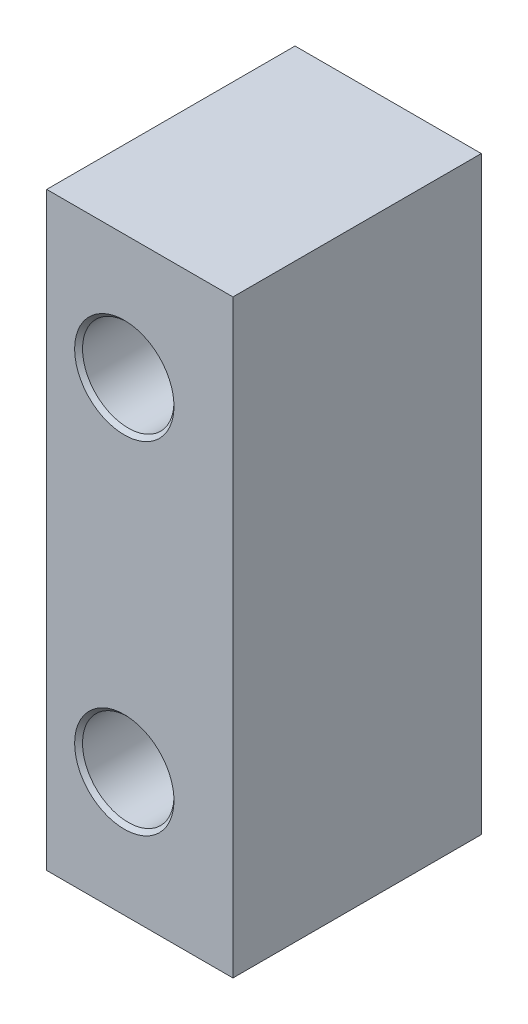
ISO-10303-21;
HEADER;
FILE_DESCRIPTION(('STEP AP214'),'2;1');
FILE_NAME('part.step','',(''),(''),'','','');
FILE_SCHEMA(('AUTOMOTIVE_DESIGN { 1 0 10303 214 1 1 1 1 }'));
ENDSEC;
DATA;
#1=APPLICATION_CONTEXT('core data for automotive mechanical design processes');
#2=APPLICATION_PROTOCOL_DEFINITION('international standard','automotive_design',2000,#1);
#3=PRODUCT_CONTEXT('',#1,'mechanical');
#4=PRODUCT('Part','Part','',(#3));
#5=PRODUCT_RELATED_PRODUCT_CATEGORY('part','',(#4));
#6=PRODUCT_DEFINITION_FORMATION('','',#4);
#7=PRODUCT_DEFINITION_CONTEXT('part definition',#1,'design');
#8=PRODUCT_DEFINITION('design','',#6,#7);
#9=PRODUCT_DEFINITION_SHAPE('','',#8);
#10=(LENGTH_UNIT() NAMED_UNIT(*) SI_UNIT(.MILLI.,.METRE.));
#11=(NAMED_UNIT(*) PLANE_ANGLE_UNIT() SI_UNIT($,.RADIAN.));
#12=(NAMED_UNIT(*) SI_UNIT($,.STERADIAN.) SOLID_ANGLE_UNIT());
#13=UNCERTAINTY_MEASURE_WITH_UNIT(LENGTH_MEASURE(1.E-05),#10,'distance_accuracy_value','');
#14=(GEOMETRIC_REPRESENTATION_CONTEXT(3) GLOBAL_UNCERTAINTY_ASSIGNED_CONTEXT((#13)) GLOBAL_UNIT_ASSIGNED_CONTEXT((#10,
#11,#12)) REPRESENTATION_CONTEXT('',''));
#15=CARTESIAN_POINT('',(0.,0.,0.));
#16=DIRECTION('',(0.,0.,1.));
#17=DIRECTION('',(1.,0.,0.));
#18=AXIS2_PLACEMENT_3D('',#15,#16,#17);
#19=CARTESIAN_POINT('',(3.,-9.5,8.));
#20=DIRECTION('',(-1.,0.,0.));
#21=DIRECTION('',(0.,0.,1.));
#22=AXIS2_PLACEMENT_3D('',#19,#20,#21);
#23=PLANE('',#22);
#24=DIRECTION('',(0.,1.,0.));
#25=VECTOR('',#24,1.);
#26=CARTESIAN_POINT('',(3.,-9.5,0.));
#27=LINE('',#26,#25);
#28=CARTESIAN_POINT('',(3.,-9.5,0.));
#29=VERTEX_POINT('',#28);
#30=CARTESIAN_POINT('',(3.,9.5,0.));
#31=VERTEX_POINT('',#30);
#32=EDGE_CURVE('E154',#29,#31,#27,.T.);
#33=ORIENTED_EDGE('',*,*,#32,.T.);
#34=DIRECTION('',(0.,0.,-1.));
#35=VECTOR('',#34,1.);
#36=CARTESIAN_POINT('',(3.,9.5,8.));
#37=LINE('',#36,#35);
#38=CARTESIAN_POINT('',(3.,9.5,8.));
#39=VERTEX_POINT('',#38);
#40=EDGE_CURVE('E135',#39,#31,#37,.T.);
#41=ORIENTED_EDGE('',*,*,#40,.F.);
#42=DIRECTION('',(0.,1.,0.));
#43=VECTOR('',#42,1.);
#44=CARTESIAN_POINT('',(3.,-9.5,8.));
#45=LINE('',#44,#43);
#46=CARTESIAN_POINT('',(3.,-9.5,8.));
#47=VERTEX_POINT('',#46);
#48=EDGE_CURVE('E142',#47,#39,#45,.T.);
#49=ORIENTED_EDGE('',*,*,#48,.F.);
#50=DIRECTION('',(0.,0.,-1.));
#51=VECTOR('',#50,1.);
#52=CARTESIAN_POINT('',(3.,-9.5,8.));
#53=LINE('',#52,#51);
#54=EDGE_CURVE('E342',#47,#29,#53,.T.);
#55=ORIENTED_EDGE('',*,*,#54,.T.);
#56=EDGE_LOOP('',(#33,#41,#49,#55));
#57=FACE_BOUND('',#56,.T.);
#58=ADVANCED_FACE('F30',(#57),#23,.F.);
#59=CARTESIAN_POINT('',(-3.,9.5,8.));
#60=DIRECTION('',(0.,-1.,0.));
#61=DIRECTION('',(0.,0.,-1.));
#62=AXIS2_PLACEMENT_3D('',#59,#60,#61);
#63=PLANE('',#62);
#64=DIRECTION('',(-1.,0.,0.));
#65=VECTOR('',#64,1.);
#66=CARTESIAN_POINT('',(-3.,9.5,0.));
#67=LINE('',#66,#65);
#68=CARTESIAN_POINT('',(-3.,9.5,0.));
#69=VERTEX_POINT('',#68);
#70=EDGE_CURVE('E344',#31,#69,#67,.T.);
#71=ORIENTED_EDGE('',*,*,#70,.T.);
#72=DIRECTION('',(0.,0.,-1.));
#73=VECTOR('',#72,1.);
#74=CARTESIAN_POINT('',(-3.,9.5,8.));
#75=LINE('',#74,#73);
#76=CARTESIAN_POINT('',(-3.,9.5,8.));
#77=VERTEX_POINT('',#76);
#78=EDGE_CURVE('E138',#77,#69,#75,.T.);
#79=ORIENTED_EDGE('',*,*,#78,.F.);
#80=DIRECTION('',(-1.,0.,0.));
#81=VECTOR('',#80,1.);
#82=CARTESIAN_POINT('',(-3.,9.5,8.));
#83=LINE('',#82,#81);
#84=EDGE_CURVE('E131',#39,#77,#83,.T.);
#85=ORIENTED_EDGE('',*,*,#84,.F.);
#86=ORIENTED_EDGE('',*,*,#40,.T.);
#87=EDGE_LOOP('',(#71,#79,#85,#86));
#88=FACE_BOUND('',#87,.T.);
#89=ADVANCED_FACE('F133',(#88),#63,.F.);
#90=CARTESIAN_POINT('',(-3.,-9.5,8.));
#91=DIRECTION('',(1.,0.,0.));
#92=DIRECTION('',(0.,0.,-1.));
#93=AXIS2_PLACEMENT_3D('',#90,#91,#92);
#94=PLANE('',#93);
#95=DIRECTION('',(0.,-1.,0.));
#96=VECTOR('',#95,1.);
#97=CARTESIAN_POINT('',(-3.,-9.5,0.));
#98=LINE('',#97,#96);
#99=CARTESIAN_POINT('',(-3.,3.8375451121956,0.));
#100=VERTEX_POINT('',#99);
#101=CARTESIAN_POINT('',(-3.,-3.8375451121956,0.));
#102=VERTEX_POINT('',#101);
#103=EDGE_CURVE('E349',#100,#102,#98,.T.);
#104=ORIENTED_EDGE('',*,*,#103,.T.);
#105=DIRECTION('',(0.,0.,1.));
#106=VECTOR('',#105,1.);
#107=CARTESIAN_POINT('',(-3.,-3.8375451121956,8.));
#108=LINE('',#107,#106);
#109=CARTESIAN_POINT('',(-3.,-3.8375451121956,2.8448));
#110=VERTEX_POINT('',#109);
#111=EDGE_CURVE('E173',#102,#110,#108,.T.);
#112=ORIENTED_EDGE('',*,*,#111,.T.);
#113=DIRECTION('',(0.,-1.,0.));
#114=VECTOR('',#113,1.);
#115=CARTESIAN_POINT('',(-3.,-9.5,2.8448));
#116=LINE('',#115,#114);
#117=CARTESIAN_POINT('',(-3.,-7.1624548878044,2.8448));
#118=VERTEX_POINT('',#117);
#119=EDGE_CURVE('E155',#110,#118,#116,.T.);
#120=ORIENTED_EDGE('',*,*,#119,.T.);
#121=DIRECTION('',(0.,0.,-1.));
#122=VECTOR('',#121,1.);
#123=CARTESIAN_POINT('',(-3.,-7.1624548878044,8.));
#124=LINE('',#123,#122);
#125=CARTESIAN_POINT('',(-3.,-7.1624548878044,0.));
#126=VERTEX_POINT('',#125);
#127=EDGE_CURVE('E170',#118,#126,#124,.T.);
#128=ORIENTED_EDGE('',*,*,#127,.T.);
#129=CARTESIAN_POINT('',(-3.,-9.5,0.));
#130=VERTEX_POINT('',#129);
#131=EDGE_CURVE('E346',#126,#130,#98,.T.);
#132=ORIENTED_EDGE('',*,*,#131,.T.);
#133=DIRECTION('',(0.,0.,-1.));
#134=VECTOR('',#133,1.);
#135=CARTESIAN_POINT('',(-3.,-9.5,8.));
#136=LINE('',#135,#134);
#137=CARTESIAN_POINT('',(-3.,-9.5,8.));
#138=VERTEX_POINT('',#137);
#139=EDGE_CURVE('E159',#138,#130,#136,.T.);
#140=ORIENTED_EDGE('',*,*,#139,.F.);
#141=DIRECTION('',(0.,-1.,0.));
#142=VECTOR('',#141,1.);
#143=CARTESIAN_POINT('',(-3.,-9.5,8.));
#144=LINE('',#143,#142);
#145=EDGE_CURVE('E141',#77,#138,#144,.T.);
#146=ORIENTED_EDGE('',*,*,#145,.F.);
#147=ORIENTED_EDGE('',*,*,#78,.T.);
#148=CARTESIAN_POINT('',(-3.,7.1624548878044,0.));
#149=VERTEX_POINT('',#148);
#150=EDGE_CURVE('E347',#69,#149,#98,.T.);
#151=ORIENTED_EDGE('',*,*,#150,.T.);
#152=DIRECTION('',(0.,0.,1.));
#153=VECTOR('',#152,1.);
#154=CARTESIAN_POINT('',(-3.,7.1624548878044,8.));
#155=LINE('',#154,#153);
#156=CARTESIAN_POINT('',(-3.,7.1624548878044,2.8448));
#157=VERTEX_POINT('',#156);
#158=EDGE_CURVE('E164',#149,#157,#155,.T.);
#159=ORIENTED_EDGE('',*,*,#158,.T.);
#160=DIRECTION('',(0.,-1.,0.));
#161=VECTOR('',#160,1.);
#162=CARTESIAN_POINT('',(-3.,-9.5,2.8448));
#163=LINE('',#162,#161);
#164=CARTESIAN_POINT('',(-3.,3.8375451121956,2.8448));
#165=VERTEX_POINT('',#164);
#166=EDGE_CURVE('E157',#157,#165,#163,.T.);
#167=ORIENTED_EDGE('',*,*,#166,.T.);
#168=DIRECTION('',(0.,0.,-1.));
#169=VECTOR('',#168,1.);
#170=CARTESIAN_POINT('',(-3.,3.8375451121956,8.));
#171=LINE('',#170,#169);
#172=EDGE_CURVE('E167',#165,#100,#171,.T.);
#173=ORIENTED_EDGE('',*,*,#172,.T.);
#174=EDGE_LOOP('',(#104,#112,#120,#128,#132,#140,#146,#147,#151,#159,#167,#173));
#175=FACE_BOUND('',#174,.T.);
#176=ADVANCED_FACE('F235',(#175),#94,.F.);
#177=CARTESIAN_POINT('',(-3.,-9.5,8.));
#178=DIRECTION('',(0.,1.,0.));
#179=DIRECTION('',(0.,0.,1.));
#180=AXIS2_PLACEMENT_3D('',#177,#178,#179);
#181=PLANE('',#180);
#182=DIRECTION('',(1.,0.,0.));
#183=VECTOR('',#182,1.);
#184=CARTESIAN_POINT('',(-3.,-9.5,0.));
#185=LINE('',#184,#183);
#186=EDGE_CURVE('E151',#130,#29,#185,.T.);
#187=ORIENTED_EDGE('',*,*,#186,.T.);
#188=ORIENTED_EDGE('',*,*,#54,.F.);
#189=DIRECTION('',(1.,0.,0.));
#190=VECTOR('',#189,1.);
#191=CARTESIAN_POINT('',(-3.,-9.5,8.));
#192=LINE('',#191,#190);
#193=EDGE_CURVE('E147',#138,#47,#192,.T.);
#194=ORIENTED_EDGE('',*,*,#193,.F.);
#195=ORIENTED_EDGE('',*,*,#139,.T.);
#196=EDGE_LOOP('',(#187,#188,#194,#195));
#197=FACE_BOUND('',#196,.T.);
#198=ADVANCED_FACE('F228',(#197),#181,.F.);
#199=CARTESIAN_POINT('',(3.,9.5,8.));
#200=DIRECTION('',(0.,0.,-1.));
#201=DIRECTION('',(-1.,0.,0.));
#202=AXIS2_PLACEMENT_3D('',#199,#200,#201);
#203=PLANE('',#202);
#204=CARTESIAN_POINT('',(-0.5,5.5,8.));
#205=DIRECTION('',(0.,0.,-1.));
#206=DIRECTION('',(-1.,0.,0.));
#207=AXIS2_PLACEMENT_3D('',#204,#205,#206);
#208=CIRCLE('',#207,1.6002);
#209=CARTESIAN_POINT('',(-2.1002,5.5,8.));
#210=VERTEX_POINT('',#209);
#211=EDGE_CURVE('E383',#210,#210,#208,.T.);
#212=ORIENTED_EDGE('',*,*,#211,.T.);
#213=EDGE_LOOP('',(#212));
#214=FACE_BOUND('',#213,.T.);
#215=CARTESIAN_POINT('',(-0.5,-5.5,8.));
#216=DIRECTION('',(0.,0.,-1.));
#217=DIRECTION('',(-1.,0.,0.));
#218=AXIS2_PLACEMENT_3D('',#215,#216,#217);
#219=CIRCLE('',#218,1.6002);
#220=CARTESIAN_POINT('',(-2.1002,-5.5,8.));
#221=VERTEX_POINT('',#220);
#222=EDGE_CURVE('E314',#221,#221,#219,.T.);
#223=ORIENTED_EDGE('',*,*,#222,.T.);
#224=EDGE_LOOP('',(#223));
#225=FACE_BOUND('',#224,.T.);
#226=ORIENTED_EDGE('',*,*,#48,.T.);
#227=ORIENTED_EDGE('',*,*,#84,.T.);
#228=ORIENTED_EDGE('',*,*,#145,.T.);
#229=ORIENTED_EDGE('',*,*,#193,.T.);
#230=EDGE_LOOP('',(#226,#227,#228,#229));
#231=FACE_BOUND('',#230,.T.);
#232=ADVANCED_FACE('F145',(#214,#225,#231),#203,.F.);
#233=CARTESIAN_POINT('',(3.,9.5,0.));
#234=DIRECTION('',(0.,0.,-1.));
#235=DIRECTION('',(-1.,0.,0.));
#236=AXIS2_PLACEMENT_3D('',#233,#234,#235);
#237=PLANE('',#236);
#238=CARTESIAN_POINT('',(-0.5,-5.5,0.));
#239=DIRECTION('',(0.,0.,-1.));
#240=DIRECTION('',(-1.,0.,0.));
#241=AXIS2_PLACEMENT_3D('',#238,#239,#240);
#242=CIRCLE('',#241,2.90576);
#243=CARTESIAN_POINT('',(-2.88304335898056,-3.83730774741126,0.));
#244=VERTEX_POINT('',#243);
#245=CARTESIAN_POINT('',(-2.88304335898056,-7.16269225258875,0.));
#246=VERTEX_POINT('',#245);
#247=EDGE_CURVE('E323',#244,#246,#242,.T.);
#248=ORIENTED_EDGE('',*,*,#247,.F.);
#249=DIRECTION('',(-0.999997940549001,-0.00202950677646935,0.));
#250=VECTOR('',#249,1.);
#251=CARTESIAN_POINT('',(3.0270438690536,-3.82531316063017,0.));
#252=LINE('',#251,#250);
#253=EDGE_CURVE('E262',#244,#102,#252,.T.);
#254=ORIENTED_EDGE('',*,*,#253,.T.);
#255=ORIENTED_EDGE('',*,*,#103,.F.);
#256=DIRECTION('',(-0.999997940549002,0.00202950677647095,0.));
#257=VECTOR('',#256,1.);
#258=CARTESIAN_POINT('',(2.9884833197144,3.82539141968752,0.));
#259=LINE('',#258,#257);
#260=CARTESIAN_POINT('',(-2.88304335898056,3.83730774741125,0.));
#261=VERTEX_POINT('',#260);
#262=EDGE_CURVE('E267',#100,#261,#259,.F.);
#263=ORIENTED_EDGE('',*,*,#262,.T.);
#264=CARTESIAN_POINT('',(-0.5,5.5,0.));
#265=DIRECTION('',(0.,0.,-1.));
#266=DIRECTION('',(-1.,0.,0.));
#267=AXIS2_PLACEMENT_3D('',#264,#265,#266);
#268=CIRCLE('',#267,2.90576);
#269=CARTESIAN_POINT('',(-2.88304335898056,7.16269225258874,0.));
#270=VERTEX_POINT('',#269);
#271=EDGE_CURVE('E381',#270,#261,#268,.T.);
#272=ORIENTED_EDGE('',*,*,#271,.F.);
#273=DIRECTION('',(-0.999997940549001,-0.00202950677646935,0.));
#274=VECTOR('',#273,1.);
#275=CARTESIAN_POINT('',(3.0047193404888,7.17464153149451,0.));
#276=LINE('',#275,#274);
#277=EDGE_CURVE('E266',#270,#149,#276,.T.);
#278=ORIENTED_EDGE('',*,*,#277,.T.);
#279=ORIENTED_EDGE('',*,*,#150,.F.);
#280=ORIENTED_EDGE('',*,*,#70,.F.);
#281=ORIENTED_EDGE('',*,*,#32,.F.);
#282=ORIENTED_EDGE('',*,*,#186,.F.);
#283=ORIENTED_EDGE('',*,*,#131,.F.);
#284=DIRECTION('',(-0.999997940549001,0.00202950677646936,0.));
#285=VECTOR('',#284,1.);
#286=CARTESIAN_POINT('',(2.96615879114961,-7.17456327243716,0.));
#287=LINE('',#286,#285);
#288=EDGE_CURVE('E272',#126,#246,#287,.F.);
#289=ORIENTED_EDGE('',*,*,#288,.T.);
#290=EDGE_LOOP('',(#248,#254,#255,#263,#272,#278,#279,#280,#281,#282,#283,#289));
#291=FACE_BOUND('',#290,.T.);
#292=ADVANCED_FACE('F212',(#291),#237,.T.);
#293=CARTESIAN_POINT('',(1.1002,-5.5,2.8448));
#294=DIRECTION('',(0.,0.,1.));
#295=DIRECTION('',(1.,0.,0.));
#296=AXIS2_PLACEMENT_3D('',#293,#294,#295);
#297=PLANE('',#296);
#298=CARTESIAN_POINT('',(-0.5,-5.5,2.8448));
#299=DIRECTION('',(0.,0.,-1.));
#300=DIRECTION('',(-1.,0.,0.));
#301=AXIS2_PLACEMENT_3D('',#298,#299,#300);
#302=CIRCLE('',#301,1.6002);
#303=CARTESIAN_POINT('',(-2.1002,-5.5,2.8448));
#304=VERTEX_POINT('',#303);
#305=EDGE_CURVE('E331',#304,#304,#302,.T.);
#306=ORIENTED_EDGE('',*,*,#305,.F.);
#307=EDGE_LOOP('',(#306));
#308=FACE_BOUND('',#307,.T.);
#309=ORIENTED_EDGE('',*,*,#119,.F.);
#310=DIRECTION('',(0.999997940549001,0.00202950677646935,0.));
#311=VECTOR('',#310,1.);
#312=CARTESIAN_POINT('',(1.09680915518356,-3.82923059312991,2.8448));
#313=LINE('',#312,#311);
#314=CARTESIAN_POINT('',(-2.72618572726878,-3.83698940312914,2.8448));
#315=VERTEX_POINT('',#314);
#316=EDGE_CURVE('E362',#110,#315,#313,.T.);
#317=ORIENTED_EDGE('',*,*,#316,.T.);
#318=CARTESIAN_POINT('',(-0.5,-5.5,2.8448));
#319=DIRECTION('',(0.,0.,-1.));
#320=DIRECTION('',(-1.,0.,0.));
#321=AXIS2_PLACEMENT_3D('',#318,#319,#320);
#322=CIRCLE('',#321,2.77876);
#323=CARTESIAN_POINT('',(-2.72618572726878,-7.16301059687086,2.8448));
#324=VERTEX_POINT('',#323);
#325=EDGE_CURVE('E328',#315,#324,#322,.T.);
#326=ORIENTED_EDGE('',*,*,#325,.T.);
#327=DIRECTION('',(0.999997940549001,-0.00202950677646936,0.));
#328=VECTOR('',#327,1.);
#329=CARTESIAN_POINT('',(1.09680915518356,-7.17076940687009,2.8448));
#330=LINE('',#329,#328);
#331=EDGE_CURVE('E366',#324,#118,#330,.F.);
#332=ORIENTED_EDGE('',*,*,#331,.T.);
#333=EDGE_LOOP('',(#309,#317,#326,#332));
#334=FACE_BOUND('',#333,.T.);
#335=ADVANCED_FACE('F208',(#308,#334),#297,.F.);
#336=CARTESIAN_POINT('',(-0.5,-5.5,0.));
#337=DIRECTION('',(0.,0.,-1.));
#338=DIRECTION('',(-1.,0.,0.));
#339=AXIS2_PLACEMENT_3D('',#336,#337,#338);
#340=CYLINDRICAL_SURFACE('',#339,2.77876);
#341=ORIENTED_EDGE('',*,*,#325,.F.);
#342=DIRECTION('',(0.,0.,-1.));
#343=VECTOR('',#342,1.);
#344=CARTESIAN_POINT('',(-2.72618572726878,-3.83698940312914,0.));
#345=LINE('',#344,#343);
#346=CARTESIAN_POINT('',(-2.72618572726878,-3.83698940312914,0.127000000000001));
#347=VERTEX_POINT('',#346);
#348=EDGE_CURVE('E178',#315,#347,#345,.T.);
#349=ORIENTED_EDGE('',*,*,#348,.T.);
#350=CARTESIAN_POINT('',(-0.5,-5.5,0.127000000000001));
#351=DIRECTION('',(0.,0.,-1.));
#352=DIRECTION('',(-1.,0.,0.));
#353=AXIS2_PLACEMENT_3D('',#350,#351,#352);
#354=CIRCLE('',#353,2.77876);
#355=CARTESIAN_POINT('',(-2.72618572726878,-7.16301059687086,0.127000000000001));
#356=VERTEX_POINT('',#355);
#357=EDGE_CURVE('E325',#347,#356,#354,.T.);
#358=ORIENTED_EDGE('',*,*,#357,.T.);
#359=DIRECTION('',(0.,0.,-1.));
#360=VECTOR('',#359,1.);
#361=CARTESIAN_POINT('',(-2.72618572726878,-7.16301059687086,0.));
#362=LINE('',#361,#360);
#363=EDGE_CURVE('E176',#356,#324,#362,.F.);
#364=ORIENTED_EDGE('',*,*,#363,.T.);
#365=EDGE_LOOP('',(#341,#349,#358,#364));
#366=FACE_BOUND('',#365,.T.);
#367=ADVANCED_FACE('F201',(#366),#340,.F.);
#368=CARTESIAN_POINT('',(-0.5,-5.5,0.));
#369=DIRECTION('',(0.,0.,-1.));
#370=DIRECTION('',(-1.,0.,0.));
#371=AXIS2_PLACEMENT_3D('',#368,#369,#370);
#372=CONICAL_SURFACE('',#371,2.90576,0.785398163397448);
#373=ORIENTED_EDGE('',*,*,#357,.F.);
#374=CARTESIAN_POINT('',(-2.72618572726878,-3.83698940312914,0.127000000000001));
#375=CARTESIAN_POINT('',(-2.75245019923403,-3.83704270716275,0.105983429878905));
#376=CARTESIAN_POINT('',(-2.77865390692182,-3.8370958878746,0.0848918095223423));
#377=CARTESIAN_POINT('',(-2.83093978411433,-3.83720200263521,0.0425584761337284));
#378=CARTESIAN_POINT('',(-2.8570219536638,-3.83725493668407,0.0213167631569572));
#379=CARTESIAN_POINT('',(-2.88304335898056,-3.83730774741126,0.));
#380=B_SPLINE_CURVE_WITH_KNOTS('',3,(#374,#375,#376,#377,#378,#379),.UNSPECIFIED.,.F.,.F.,(4,2,
4),(0.,0.100913042597901,0.201826048030678),.UNSPECIFIED.);
#381=EDGE_CURVE('E187',#347,#244,#380,.T.);
#382=ORIENTED_EDGE('',*,*,#381,.T.);
#383=ORIENTED_EDGE('',*,*,#247,.T.);
#384=CARTESIAN_POINT('',(-2.88304335898056,-7.16269225258875,0.));
#385=CARTESIAN_POINT('',(-2.8570219536638,-7.16274506331593,0.0213167631569572));
#386=CARTESIAN_POINT('',(-2.83093978411433,-7.16279799736479,0.0425584761337283));
#387=CARTESIAN_POINT('',(-2.77865390692183,-7.16290411212541,0.0848918095223423));
#388=CARTESIAN_POINT('',(-2.75245019923403,-7.16295729283725,0.105983429878905));
#389=CARTESIAN_POINT('',(-2.72618572726878,-7.16301059687086,0.127000000000001));
#390=B_SPLINE_CURVE_WITH_KNOTS('',3,(#384,#385,#386,#387,#388,#389),.UNSPECIFIED.,.F.,.F.,(4,2,
4),(0.,0.100913005432777,0.201826048030678),.UNSPECIFIED.);
#391=EDGE_CURVE('E180',#246,#356,#390,.T.);
#392=ORIENTED_EDGE('',*,*,#391,.T.);
#393=EDGE_LOOP('',(#373,#382,#383,#392));
#394=FACE_BOUND('',#393,.T.);
#395=ADVANCED_FACE('F195',(#394),#372,.F.);
#396=CARTESIAN_POINT('',(-0.5,-5.5,7.873));
#397=DIRECTION('',(0.,0.,1.));
#398=DIRECTION('',(1.,0.,0.));
#399=AXIS2_PLACEMENT_3D('',#396,#397,#398);
#400=CONICAL_SURFACE('',#399,1.4732,0.785398163397448);
#401=ORIENTED_EDGE('',*,*,#222,.F.);
#402=EDGE_LOOP('',(#401));
#403=FACE_BOUND('',#402,.T.);
#404=CARTESIAN_POINT('',(-0.5,-5.5,7.873));
#405=DIRECTION('',(0.,0.,-1.));
#406=DIRECTION('',(-1.,0.,0.));
#407=AXIS2_PLACEMENT_3D('',#404,#405,#406);
#408=CIRCLE('',#407,1.4732);
#409=CARTESIAN_POINT('',(-1.9732,-5.5,7.873));
#410=VERTEX_POINT('',#409);
#411=EDGE_CURVE('E337',#410,#410,#408,.T.);
#412=ORIENTED_EDGE('',*,*,#411,.T.);
#413=EDGE_LOOP('',(#412));
#414=FACE_BOUND('',#413,.T.);
#415=ADVANCED_FACE('F200',(#403,#414),#400,.F.);
#416=CARTESIAN_POINT('',(-0.5,-5.5,0.));
#417=DIRECTION('',(0.,0.,-1.));
#418=DIRECTION('',(-1.,0.,0.));
#419=AXIS2_PLACEMENT_3D('',#416,#417,#418);
#420=CYLINDRICAL_SURFACE('',#419,1.4732);
#421=ORIENTED_EDGE('',*,*,#411,.F.);
#422=EDGE_LOOP('',(#421));
#423=FACE_BOUND('',#422,.T.);
#424=CARTESIAN_POINT('',(-0.5,-5.5,2.9718));
#425=DIRECTION('',(0.,0.,-1.));
#426=DIRECTION('',(-1.,0.,0.));
#427=AXIS2_PLACEMENT_3D('',#424,#425,#426);
#428=CIRCLE('',#427,1.4732);
#429=CARTESIAN_POINT('',(-1.9732,-5.5,2.9718));
#430=VERTEX_POINT('',#429);
#431=EDGE_CURVE('E334',#430,#430,#428,.T.);
#432=ORIENTED_EDGE('',*,*,#431,.T.);
#433=EDGE_LOOP('',(#432));
#434=FACE_BOUND('',#433,.T.);
#435=ADVANCED_FACE('F218',(#423,#434),#420,.F.);
#436=CARTESIAN_POINT('',(-0.5,-5.5,2.8448));
#437=DIRECTION('',(0.,0.,-1.));
#438=DIRECTION('',(-1.,0.,0.));
#439=AXIS2_PLACEMENT_3D('',#436,#437,#438);
#440=CONICAL_SURFACE('',#439,1.6002,0.785398163397448);
#441=ORIENTED_EDGE('',*,*,#431,.F.);
#442=EDGE_LOOP('',(#441));
#443=FACE_BOUND('',#442,.T.);
#444=ORIENTED_EDGE('',*,*,#305,.T.);
#445=EDGE_LOOP('',(#444));
#446=FACE_BOUND('',#445,.T.);
#447=ADVANCED_FACE('F214',(#443,#446),#440,.F.);
#448=CARTESIAN_POINT('',(1.1002,5.5,2.8448));
#449=DIRECTION('',(0.,0.,1.));
#450=DIRECTION('',(1.,0.,0.));
#451=AXIS2_PLACEMENT_3D('',#448,#449,#450);
#452=PLANE('',#451);
#453=CARTESIAN_POINT('',(-0.5,5.5,2.8448));
#454=DIRECTION('',(0.,0.,-1.));
#455=DIRECTION('',(-1.,0.,0.));
#456=AXIS2_PLACEMENT_3D('',#453,#454,#455);
#457=CIRCLE('',#456,1.6002);
#458=CARTESIAN_POINT('',(-2.1002,5.5,2.8448));
#459=VERTEX_POINT('',#458);
#460=EDGE_CURVE('E312',#459,#459,#457,.T.);
#461=ORIENTED_EDGE('',*,*,#460,.F.);
#462=EDGE_LOOP('',(#461));
#463=FACE_BOUND('',#462,.T.);
#464=ORIENTED_EDGE('',*,*,#166,.F.);
#465=DIRECTION('',(0.999997940549001,0.00202950677646935,0.));
#466=VECTOR('',#465,1.);
#467=CARTESIAN_POINT('',(1.09680915518356,7.17076940687009,2.8448));
#468=LINE('',#467,#466);
#469=CARTESIAN_POINT('',(-2.72618572726878,7.16301059687086,2.8448));
#470=VERTEX_POINT('',#469);
#471=EDGE_CURVE('E11',#157,#470,#468,.T.);
#472=ORIENTED_EDGE('',*,*,#471,.T.);
#473=CARTESIAN_POINT('',(-0.5,5.5,2.8448));
#474=DIRECTION('',(0.,0.,-1.));
#475=DIRECTION('',(-1.,0.,0.));
#476=AXIS2_PLACEMENT_3D('',#473,#474,#475);
#477=CIRCLE('',#476,2.77876);
#478=CARTESIAN_POINT('',(-2.72618572726878,3.83698940312914,2.8448));
#479=VERTEX_POINT('',#478);
#480=EDGE_CURVE('E317',#470,#479,#477,.T.);
#481=ORIENTED_EDGE('',*,*,#480,.T.);
#482=DIRECTION('',(0.999997940549002,-0.00202950677647095,0.));
#483=VECTOR('',#482,1.);
#484=CARTESIAN_POINT('',(1.09680915518356,3.8292305931299,2.8448));
#485=LINE('',#484,#483);
#486=EDGE_CURVE('E39',#479,#165,#485,.F.);
#487=ORIENTED_EDGE('',*,*,#486,.T.);
#488=EDGE_LOOP('',(#464,#472,#481,#487));
#489=FACE_BOUND('',#488,.T.);
#490=ADVANCED_FACE('F217',(#463,#489),#452,.F.);
#491=CARTESIAN_POINT('',(-0.5,5.5,0.));
#492=DIRECTION('',(0.,0.,-1.));
#493=DIRECTION('',(-1.,0.,0.));
#494=AXIS2_PLACEMENT_3D('',#491,#492,#493);
#495=CYLINDRICAL_SURFACE('',#494,2.77876);
#496=CARTESIAN_POINT('',(-0.5,5.5,0.127000000000001));
#497=DIRECTION('',(0.,0.,-1.));
#498=DIRECTION('',(-1.,0.,0.));
#499=AXIS2_PLACEMENT_3D('',#496,#497,#498);
#500=CIRCLE('',#499,2.77876);
#501=CARTESIAN_POINT('',(-2.72618572726878,7.16301059687085,0.127000000000001));
#502=VERTEX_POINT('',#501);
#503=CARTESIAN_POINT('',(-2.72618572726878,3.83698940312914,0.127000000000001));
#504=VERTEX_POINT('',#503);
#505=EDGE_CURVE('E382',#502,#504,#500,.T.);
#506=ORIENTED_EDGE('',*,*,#505,.T.);
#507=DIRECTION('',(0.,0.,-1.));
#508=VECTOR('',#507,1.);
#509=CARTESIAN_POINT('',(-2.72618572726878,3.83698940312914,0.));
#510=LINE('',#509,#508);
#511=EDGE_CURVE('E46',#504,#479,#510,.F.);
#512=ORIENTED_EDGE('',*,*,#511,.T.);
#513=ORIENTED_EDGE('',*,*,#480,.F.);
#514=DIRECTION('',(0.,0.,-1.));
#515=VECTOR('',#514,1.);
#516=CARTESIAN_POINT('',(-2.72618572726878,7.16301059687086,0.));
#517=LINE('',#516,#515);
#518=EDGE_CURVE('E360',#470,#502,#517,.T.);
#519=ORIENTED_EDGE('',*,*,#518,.T.);
#520=EDGE_LOOP('',(#506,#512,#513,#519));
#521=FACE_BOUND('',#520,.T.);
#522=ADVANCED_FACE('F292',(#521),#495,.F.);
#523=CARTESIAN_POINT('',(-0.5,5.5,0.));
#524=DIRECTION('',(0.,0.,-1.));
#525=DIRECTION('',(-1.,0.,0.));
#526=AXIS2_PLACEMENT_3D('',#523,#524,#525);
#527=CONICAL_SURFACE('',#526,2.90576,0.785398163397448);
#528=ORIENTED_EDGE('',*,*,#271,.T.);
#529=CARTESIAN_POINT('',(-2.88304335898056,3.83730774741125,0.));
#530=CARTESIAN_POINT('',(-2.8570219536638,3.83725493668407,0.0213167631569573));
#531=CARTESIAN_POINT('',(-2.83093978411433,3.83720200263521,0.0425584761337285));
#532=CARTESIAN_POINT('',(-2.77865390692183,3.83709588787459,0.0848918095223424));
#533=CARTESIAN_POINT('',(-2.75245019923404,3.83704270716275,0.105983429878905));
#534=CARTESIAN_POINT('',(-2.72618572726878,3.83698940312914,0.127000000000001));
#535=B_SPLINE_CURVE_WITH_KNOTS('',3,(#529,#530,#531,#532,#533,#534),.UNSPECIFIED.,.F.,.F.,(4,2,
4),(0.,0.100913005432776,0.201826048030677),.UNSPECIFIED.);
#536=EDGE_CURVE('E283',#261,#504,#535,.T.);
#537=ORIENTED_EDGE('',*,*,#536,.T.);
#538=ORIENTED_EDGE('',*,*,#505,.F.);
#539=CARTESIAN_POINT('',(-2.72618572726878,7.16301059687086,0.127000000000001));
#540=CARTESIAN_POINT('',(-2.75245019923403,7.16295729283724,0.105983429878905));
#541=CARTESIAN_POINT('',(-2.77865390692182,7.1629041121254,0.0848918095223423));
#542=CARTESIAN_POINT('',(-2.83093978411433,7.16279799736479,0.0425584761337285));
#543=CARTESIAN_POINT('',(-2.8570219536638,7.16274506331593,0.0213167631569574));
#544=CARTESIAN_POINT('',(-2.88304335898056,7.16269225258874,0.));
#545=B_SPLINE_CURVE_WITH_KNOTS('',3,(#539,#540,#541,#542,#543,#544),.UNSPECIFIED.,.F.,.F.,(4,2,
4),(0.,0.100913042597901,0.201826048030677),.UNSPECIFIED.);
#546=EDGE_CURVE('E277',#502,#270,#545,.T.);
#547=ORIENTED_EDGE('',*,*,#546,.T.);
#548=EDGE_LOOP('',(#528,#537,#538,#547));
#549=FACE_BOUND('',#548,.T.);
#550=ADVANCED_FACE('F288',(#549),#527,.F.);
#551=CARTESIAN_POINT('',(-0.5,5.5,7.873));
#552=DIRECTION('',(0.,0.,1.));
#553=DIRECTION('',(1.,0.,0.));
#554=AXIS2_PLACEMENT_3D('',#551,#552,#553);
#555=CONICAL_SURFACE('',#554,1.4732,0.785398163397448);
#556=ORIENTED_EDGE('',*,*,#211,.F.);
#557=EDGE_LOOP('',(#556));
#558=FACE_BOUND('',#557,.T.);
#559=CARTESIAN_POINT('',(-0.5,5.5,7.873));
#560=DIRECTION('',(0.,0.,-1.));
#561=DIRECTION('',(-1.,0.,0.));
#562=AXIS2_PLACEMENT_3D('',#559,#560,#561);
#563=CIRCLE('',#562,1.4732);
#564=CARTESIAN_POINT('',(-1.9732,5.5,7.873));
#565=VERTEX_POINT('',#564);
#566=EDGE_CURVE('E308',#565,#565,#563,.T.);
#567=ORIENTED_EDGE('',*,*,#566,.T.);
#568=EDGE_LOOP('',(#567));
#569=FACE_BOUND('',#568,.T.);
#570=ADVANCED_FACE('F203',(#558,#569),#555,.F.);
#571=CARTESIAN_POINT('',(-0.5,5.5,0.));
#572=DIRECTION('',(0.,0.,-1.));
#573=DIRECTION('',(-1.,0.,0.));
#574=AXIS2_PLACEMENT_3D('',#571,#572,#573);
#575=CYLINDRICAL_SURFACE('',#574,1.4732);
#576=ORIENTED_EDGE('',*,*,#566,.F.);
#577=EDGE_LOOP('',(#576));
#578=FACE_BOUND('',#577,.T.);
#579=CARTESIAN_POINT('',(-0.5,5.5,2.9718));
#580=DIRECTION('',(0.,0.,-1.));
#581=DIRECTION('',(-1.,0.,0.));
#582=AXIS2_PLACEMENT_3D('',#579,#580,#581);
#583=CIRCLE('',#582,1.4732);
#584=CARTESIAN_POINT('',(-1.9732,5.5,2.9718));
#585=VERTEX_POINT('',#584);
#586=EDGE_CURVE('E311',#585,#585,#583,.T.);
#587=ORIENTED_EDGE('',*,*,#586,.T.);
#588=EDGE_LOOP('',(#587));
#589=FACE_BOUND('',#588,.T.);
#590=ADVANCED_FACE('F254',(#578,#589),#575,.F.);
#591=CARTESIAN_POINT('',(-0.5,5.5,2.8448));
#592=DIRECTION('',(0.,0.,-1.));
#593=DIRECTION('',(-1.,0.,0.));
#594=AXIS2_PLACEMENT_3D('',#591,#592,#593);
#595=CONICAL_SURFACE('',#594,1.6002,0.785398163397448);
#596=ORIENTED_EDGE('',*,*,#586,.F.);
#597=EDGE_LOOP('',(#596));
#598=FACE_BOUND('',#597,.T.);
#599=ORIENTED_EDGE('',*,*,#460,.T.);
#600=EDGE_LOOP('',(#599));
#601=FACE_BOUND('',#600,.T.);
#602=ADVANCED_FACE('F246',(#598,#601),#595,.F.);
#603=CARTESIAN_POINT('',(-3.,-3.8375451121956,0.));
#604=DIRECTION('',(0.00202950677646935,-0.999997940549001,0.));
#605=DIRECTION('',(0.999997940549001,0.00202950677646935,0.));
#606=AXIS2_PLACEMENT_3D('',#603,#604,#605);
#607=PLANE('',#606);
#608=ORIENTED_EDGE('',*,*,#381,.F.);
#609=ORIENTED_EDGE('',*,*,#348,.F.);
#610=ORIENTED_EDGE('',*,*,#316,.F.);
#611=ORIENTED_EDGE('',*,*,#111,.F.);
#612=ORIENTED_EDGE('',*,*,#253,.F.);
#613=EDGE_LOOP('',(#608,#609,#610,#611,#612));
#614=FACE_BOUND('',#613,.T.);
#615=ADVANCED_FACE('F243',(#614),#607,.T.);
#616=CARTESIAN_POINT('',(-3.,-7.1624548878044,0.));
#617=DIRECTION('',(-0.00202950677646936,-0.999997940549001,0.));
#618=DIRECTION('',(0.999997940549001,-0.00202950677646936,0.));
#619=AXIS2_PLACEMENT_3D('',#616,#617,#618);
#620=PLANE('',#619);
#621=ORIENTED_EDGE('',*,*,#331,.F.);
#622=ORIENTED_EDGE('',*,*,#363,.F.);
#623=ORIENTED_EDGE('',*,*,#391,.F.);
#624=ORIENTED_EDGE('',*,*,#288,.F.);
#625=ORIENTED_EDGE('',*,*,#127,.F.);
#626=EDGE_LOOP('',(#621,#622,#623,#624,#625));
#627=FACE_BOUND('',#626,.T.);
#628=ADVANCED_FACE('F193',(#627),#620,.F.);
#629=CARTESIAN_POINT('',(-3.,3.8375451121956,0.));
#630=DIRECTION('',(-0.00202950677647095,-0.999997940549001,0.));
#631=DIRECTION('',(0.999997940549002,-0.00202950677647095,0.));
#632=AXIS2_PLACEMENT_3D('',#629,#630,#631);
#633=PLANE('',#632);
#634=ORIENTED_EDGE('',*,*,#486,.F.);
#635=ORIENTED_EDGE('',*,*,#511,.F.);
#636=ORIENTED_EDGE('',*,*,#536,.F.);
#637=ORIENTED_EDGE('',*,*,#262,.F.);
#638=ORIENTED_EDGE('',*,*,#172,.F.);
#639=EDGE_LOOP('',(#634,#635,#636,#637,#638));
#640=FACE_BOUND('',#639,.T.);
#641=ADVANCED_FACE('F252',(#640),#633,.F.);
#642=CARTESIAN_POINT('',(-3.,7.1624548878044,0.));
#643=DIRECTION('',(0.00202950677646935,-0.999997940549001,0.));
#644=DIRECTION('',(0.999997940549001,0.00202950677646935,0.));
#645=AXIS2_PLACEMENT_3D('',#642,#643,#644);
#646=PLANE('',#645);
#647=ORIENTED_EDGE('',*,*,#546,.F.);
#648=ORIENTED_EDGE('',*,*,#518,.F.);
#649=ORIENTED_EDGE('',*,*,#471,.F.);
#650=ORIENTED_EDGE('',*,*,#158,.F.);
#651=ORIENTED_EDGE('',*,*,#277,.F.);
#652=EDGE_LOOP('',(#647,#648,#649,#650,#651));
#653=FACE_BOUND('',#652,.T.);
#654=ADVANCED_FACE('F32',(#653),#646,.T.);
#655=CLOSED_SHELL('',(#58,#89,#176,#198,#232,#292,#335,#367,#395,#415,#435,#447,#490,#522,#550,
#570,#590,#602,#615,#628,#641,#654));
#656=MANIFOLD_SOLID_BREP('B2',#655);
#657=ADVANCED_BREP_SHAPE_REPRESENTATION('',(#18,#656),#14);
#658=SHAPE_DEFINITION_REPRESENTATION(#9,#657);
ENDSEC;
END-ISO-10303-21;
